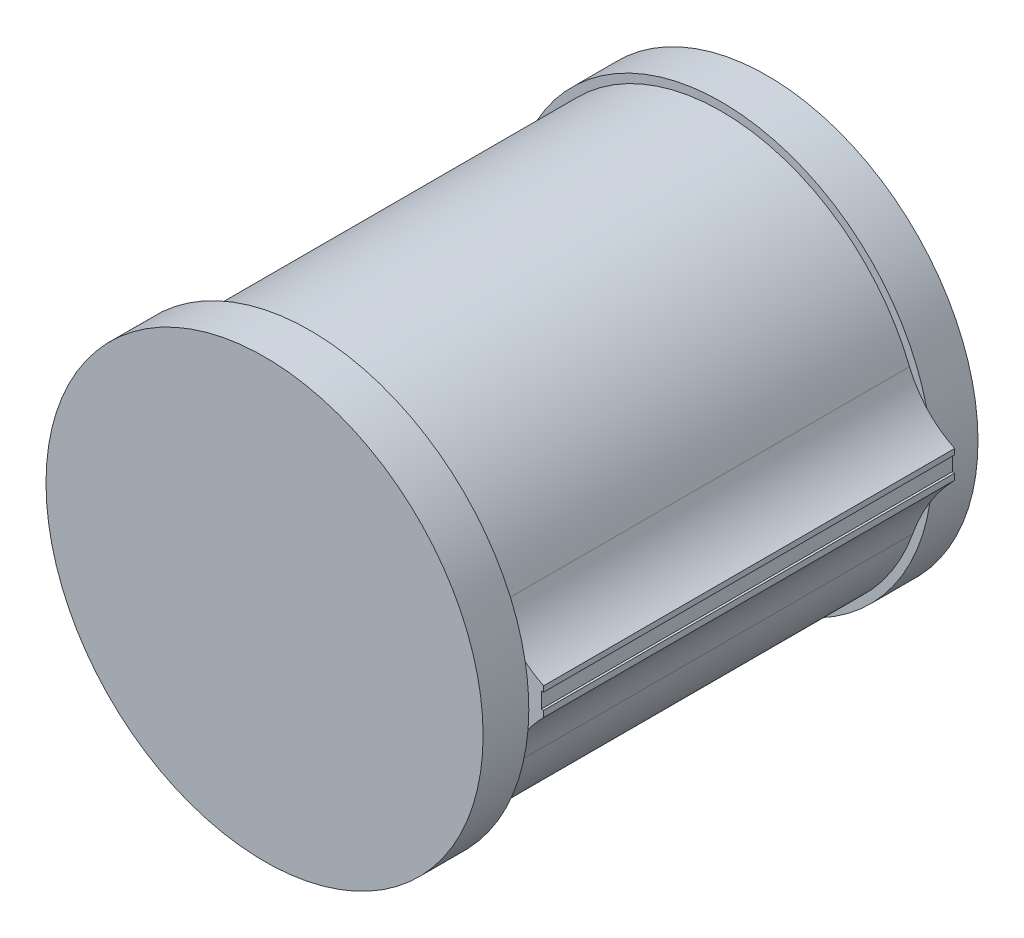
ISO-10303-21;
HEADER;
FILE_DESCRIPTION(('STEP AP214'),'2;1');
FILE_NAME('part.step','',(''),(''),'','','');
FILE_SCHEMA(('AUTOMOTIVE_DESIGN { 1 0 10303 214 1 1 1 1 }'));
ENDSEC;
DATA;
#1=APPLICATION_CONTEXT('core data for automotive mechanical design processes');
#2=APPLICATION_PROTOCOL_DEFINITION('international standard','automotive_design',2000,#1);
#3=PRODUCT_CONTEXT('',#1,'mechanical');
#4=PRODUCT('Part','Part','',(#3));
#5=PRODUCT_RELATED_PRODUCT_CATEGORY('part','',(#4));
#6=PRODUCT_DEFINITION_FORMATION('','',#4);
#7=PRODUCT_DEFINITION_CONTEXT('part definition',#1,'design');
#8=PRODUCT_DEFINITION('design','',#6,#7);
#9=PRODUCT_DEFINITION_SHAPE('','',#8);
#10=(LENGTH_UNIT() NAMED_UNIT(*) SI_UNIT(.MILLI.,.METRE.));
#11=(NAMED_UNIT(*) PLANE_ANGLE_UNIT() SI_UNIT($,.RADIAN.));
#12=(NAMED_UNIT(*) SI_UNIT($,.STERADIAN.) SOLID_ANGLE_UNIT());
#13=UNCERTAINTY_MEASURE_WITH_UNIT(LENGTH_MEASURE(1.E-05),#10,'distance_accuracy_value','');
#14=(GEOMETRIC_REPRESENTATION_CONTEXT(3) GLOBAL_UNCERTAINTY_ASSIGNED_CONTEXT((#13)) GLOBAL_UNIT_ASSIGNED_CONTEXT((#10,
#11,#12)) REPRESENTATION_CONTEXT('',''));
#15=CARTESIAN_POINT('',(0.,0.,0.));
#16=DIRECTION('',(0.,0.,1.));
#17=DIRECTION('',(1.,0.,0.));
#18=AXIS2_PLACEMENT_3D('',#15,#16,#17);
#19=CARTESIAN_POINT('',(-36.7877662650769,-29.4576403006456,40.));
#20=DIRECTION('',(-1.,0.,0.));
#21=DIRECTION('',(0.,0.,1.));
#22=AXIS2_PLACEMENT_3D('',#19,#20,#21);
#23=PLANE('',#22);
#24=DIRECTION('',(0.,1.,0.));
#25=VECTOR('',#24,1.);
#26=CARTESIAN_POINT('',(-36.7877662650769,-29.4576403006456,40.));
#27=LINE('',#26,#25);
#28=CARTESIAN_POINT('',(-36.7877662650769,14.3311362521633,40.));
#29=VERTEX_POINT('',#28);
#30=CARTESIAN_POINT('',(-36.7877662650769,15.5423596993544,40.));
#31=VERTEX_POINT('',#30);
#32=EDGE_CURVE('E146',#29,#31,#27,.T.);
#33=ORIENTED_EDGE('',*,*,#32,.F.);
#34=DIRECTION('',(0.,0.,1.));
#35=VECTOR('',#34,1.);
#36=CARTESIAN_POINT('',(-36.7877662650769,14.3311362521633,40.));
#37=LINE('',#36,#35);
#38=CARTESIAN_POINT('',(-36.7877662650769,14.3311362521633,-50.));
#39=VERTEX_POINT('',#38);
#40=EDGE_CURVE('E127',#39,#29,#37,.T.);
#41=ORIENTED_EDGE('',*,*,#40,.F.);
#42=DIRECTION('',(0.,1.,0.));
#43=VECTOR('',#42,1.);
#44=CARTESIAN_POINT('',(-36.7877662650769,-29.4576403006456,-50.));
#45=LINE('',#44,#43);
#46=CARTESIAN_POINT('',(-36.7877662650769,15.5423596993544,-50.));
#47=VERTEX_POINT('',#46);
#48=EDGE_CURVE('E142',#39,#47,#45,.T.);
#49=ORIENTED_EDGE('',*,*,#48,.T.);
#50=DIRECTION('',(0.,0.,1.));
#51=VECTOR('',#50,1.);
#52=CARTESIAN_POINT('',(-36.7877662650769,15.5423596993544,40.));
#53=LINE('',#52,#51);
#54=EDGE_CURVE('E139',#47,#31,#53,.T.);
#55=ORIENTED_EDGE('',*,*,#54,.T.);
#56=EDGE_LOOP('',(#33,#41,#49,#55));
#57=FACE_BOUND('',#56,.T.);
#58=ADVANCED_FACE('F32',(#57),#23,.F.);
#59=CARTESIAN_POINT('',(-87.8841880463567,9.52001668341595,50.));
#60=DIRECTION('',(0.,0.,-1.));
#61=DIRECTION('',(-1.,0.,0.));
#62=AXIS2_PLACEMENT_3D('',#59,#60,#61);
#63=CYLINDRICAL_SURFACE('',#62,44.4223354879125);
#64=CARTESIAN_POINT('',(-87.8841880463567,9.52001668341595,-50.));
#65=DIRECTION('',(0.,0.,-1.));
#66=DIRECTION('',(-1.,0.,0.));
#67=AXIS2_PLACEMENT_3D('',#64,#65,#66);
#68=CIRCLE('',#67,44.4223354879125);
#69=CARTESIAN_POINT('',(-45.9816918437156,-5.22870197917657,-50.));
#70=VERTEX_POINT('',#69);
#71=CARTESIAN_POINT('',(-46.6721157174866,26.1003961893452,-50.));
#72=VERTEX_POINT('',#71);
#73=EDGE_CURVE('E166',#70,#72,#68,.T.);
#74=ORIENTED_EDGE('',*,*,#73,.F.);
#75=DIRECTION('',(0.,0.,-1.));
#76=VECTOR('',#75,1.);
#77=CARTESIAN_POINT('',(-45.9816918437156,-5.22870197917657,50.));
#78=LINE('',#77,#76);
#79=CARTESIAN_POINT('',(-45.9816918437156,-5.22870197917657,40.));
#80=VERTEX_POINT('',#79);
#81=EDGE_CURVE('E184',#70,#80,#78,.F.);
#82=ORIENTED_EDGE('',*,*,#81,.T.);
#83=CARTESIAN_POINT('',(-87.8841880463567,9.52001668341595,40.));
#84=DIRECTION('',(0.,0.,1.));
#85=DIRECTION('',(1.,0.,0.));
#86=AXIS2_PLACEMENT_3D('',#83,#84,#85);
#87=CIRCLE('',#86,44.4223354879125);
#88=CARTESIAN_POINT('',(-46.6721157174866,26.1003961893452,40.));
#89=VERTEX_POINT('',#88);
#90=EDGE_CURVE('E169',#89,#80,#87,.T.);
#91=ORIENTED_EDGE('',*,*,#90,.F.);
#92=DIRECTION('',(0.,0.,-1.));
#93=VECTOR('',#92,1.);
#94=CARTESIAN_POINT('',(-46.6721157174866,26.1003961893452,50.));
#95=LINE('',#94,#93);
#96=EDGE_CURVE('E172',#89,#72,#95,.T.);
#97=ORIENTED_EDGE('',*,*,#96,.T.);
#98=EDGE_LOOP('',(#74,#82,#91,#97));
#99=FACE_BOUND('',#98,.T.);
#100=ADVANCED_FACE('F229',(#99),#63,.T.);
#101=CARTESIAN_POINT('',(-87.8841880463567,9.52001668341595,-60.));
#102=DIRECTION('',(0.,0.,1.));
#103=DIRECTION('',(1.,0.,0.));
#104=AXIS2_PLACEMENT_3D('',#101,#102,#103);
#105=CYLINDRICAL_SURFACE('',#104,46.1995658048542);
#106=CARTESIAN_POINT('',(-87.8841880463567,9.52001668341595,-60.));
#107=DIRECTION('',(0.,0.,-1.));
#108=DIRECTION('',(-1.,0.,0.));
#109=AXIS2_PLACEMENT_3D('',#106,#107,#108);
#110=CIRCLE('',#109,46.1995658048542);
#111=CARTESIAN_POINT('',(-134.083753851211,9.52001668341595,-60.));
#112=VERTEX_POINT('',#111);
#113=EDGE_CURVE('E163',#112,#112,#110,.T.);
#114=ORIENTED_EDGE('',*,*,#113,.F.);
#115=EDGE_LOOP('',(#114));
#116=FACE_BOUND('',#115,.T.);
#117=CARTESIAN_POINT('',(-87.8841880463567,9.52001668341595,-50.));
#118=DIRECTION('',(0.,0.,-1.));
#119=DIRECTION('',(-1.,0.,0.));
#120=AXIS2_PLACEMENT_3D('',#117,#118,#119);
#121=CIRCLE('',#120,46.1995658048542);
#122=CARTESIAN_POINT('',(-42.9147772678131,20.1101996274288,-50.));
#123=VERTEX_POINT('',#122);
#124=CARTESIAN_POINT('',(-42.1989733391257,2.6453503125105,-50.));
#125=VERTEX_POINT('',#124);
#126=EDGE_CURVE('E46',#123,#125,#121,.T.);
#127=ORIENTED_EDGE('',*,*,#126,.T.);
#128=EDGE_CURVE('E159',#125,#123,#121,.T.);
#129=ORIENTED_EDGE('',*,*,#128,.T.);
#130=EDGE_LOOP('',(#127,#129));
#131=FACE_BOUND('',#130,.T.);
#132=ADVANCED_FACE('F257',(#116,#131),#105,.T.);
#133=CARTESIAN_POINT('',(-87.8841880463567,9.52001668341595,-60.));
#134=DIRECTION('',(0.,0.,-1.));
#135=DIRECTION('',(-1.,0.,0.));
#136=AXIS2_PLACEMENT_3D('',#133,#134,#135);
#137=PLANE('',#136);
#138=CARTESIAN_POINT('',(-87.8841880463567,9.52001668341595,-60.));
#139=DIRECTION('',(0.,0.,-1.));
#140=DIRECTION('',(-1.,0.,0.));
#141=AXIS2_PLACEMENT_3D('',#138,#139,#140);
#142=CIRCLE('',#141,40.5181852656169);
#143=CARTESIAN_POINT('',(-128.402373311974,9.52001668341595,-60.));
#144=VERTEX_POINT('',#143);
#145=EDGE_CURVE('E151',#144,#144,#142,.T.);
#146=ORIENTED_EDGE('',*,*,#145,.F.);
#147=EDGE_LOOP('',(#146));
#148=FACE_BOUND('',#147,.T.);
#149=ORIENTED_EDGE('',*,*,#113,.T.);
#150=EDGE_LOOP('',(#149));
#151=FACE_BOUND('',#150,.T.);
#152=ADVANCED_FACE('F274',(#148,#151),#137,.T.);
#153=CARTESIAN_POINT('',(-87.8841880463567,9.52001668341595,-50.));
#154=DIRECTION('',(0.,0.,-1.));
#155=DIRECTION('',(-1.,0.,0.));
#156=AXIS2_PLACEMENT_3D('',#153,#154,#155);
#157=PLANE('',#156);
#158=ORIENTED_EDGE('',*,*,#128,.F.);
#159=CARTESIAN_POINT('',(-8.25067591003705,-18.5091551571557,-50.));
#160=DIRECTION('',(0.,0.,-1.));
#161=DIRECTION('',(-1.,0.,0.));
#162=AXIS2_PLACEMENT_3D('',#159,#160,#161);
#163=CIRCLE('',#162,40.);
#164=EDGE_CURVE('E189',#125,#70,#163,.F.);
#165=ORIENTED_EDGE('',*,*,#164,.T.);
#166=ORIENTED_EDGE('',*,*,#73,.T.);
#167=CARTESIAN_POINT('',(-28.1174531243486,33.5652803850178,-50.));
#168=DIRECTION('',(0.,0.,-1.));
#169=DIRECTION('',(-1.,0.,0.));
#170=AXIS2_PLACEMENT_3D('',#167,#168,#169);
#171=CIRCLE('',#170,20.);
#172=EDGE_CURVE('E175',#72,#123,#171,.F.);
#173=ORIENTED_EDGE('',*,*,#172,.T.);
#174=EDGE_LOOP('',(#158,#165,#166,#173));
#175=FACE_BOUND('',#174,.T.);
#176=ADVANCED_FACE('F234',(#175),#157,.F.);
#177=CARTESIAN_POINT('',(-87.8841880463567,9.52001668341595,40.));
#178=DIRECTION('',(0.,0.,1.));
#179=DIRECTION('',(1.,0.,0.));
#180=AXIS2_PLACEMENT_3D('',#177,#178,#179);
#181=CYLINDRICAL_SURFACE('',#180,47.848668402323);
#182=CARTESIAN_POINT('',(-87.8841880463567,9.52001668341595,40.));
#183=DIRECTION('',(0.,0.,1.));
#184=DIRECTION('',(1.,0.,0.));
#185=AXIS2_PLACEMENT_3D('',#182,#183,#184);
#186=CIRCLE('',#185,47.848668402323);
#187=CARTESIAN_POINT('',(-40.1997902423232,5.55854297504036,40.));
#188=VERTEX_POINT('',#187);
#189=CARTESIAN_POINT('',(-40.8131645801487,18.1115135098813,40.));
#190=VERTEX_POINT('',#189);
#191=EDGE_CURVE('E54',#188,#190,#186,.T.);
#192=ORIENTED_EDGE('',*,*,#191,.T.);
#193=EDGE_CURVE('E160',#190,#188,#186,.T.);
#194=ORIENTED_EDGE('',*,*,#193,.T.);
#195=EDGE_LOOP('',(#192,#194));
#196=FACE_BOUND('',#195,.T.);
#197=CARTESIAN_POINT('',(-87.8841880463567,9.52001668341595,50.));
#198=DIRECTION('',(0.,0.,1.));
#199=DIRECTION('',(1.,0.,0.));
#200=AXIS2_PLACEMENT_3D('',#197,#198,#199);
#201=CIRCLE('',#200,47.848668402323);
#202=CARTESIAN_POINT('',(-40.0355196440336,9.52001668341595,50.));
#203=VERTEX_POINT('',#202);
#204=EDGE_CURVE('E155',#203,#203,#201,.T.);
#205=ORIENTED_EDGE('',*,*,#204,.F.);
#206=EDGE_LOOP('',(#205));
#207=FACE_BOUND('',#206,.T.);
#208=ADVANCED_FACE('F231',(#196,#207),#181,.T.);
#209=CARTESIAN_POINT('',(-87.8841880463567,9.52001668341595,40.));
#210=DIRECTION('',(0.,0.,1.));
#211=DIRECTION('',(1.,0.,0.));
#212=AXIS2_PLACEMENT_3D('',#209,#210,#211);
#213=PLANE('',#212);
#214=ORIENTED_EDGE('',*,*,#90,.T.);
#215=CARTESIAN_POINT('',(-8.25067591003705,-18.5091551571557,40.));
#216=DIRECTION('',(0.,0.,1.));
#217=DIRECTION('',(1.,0.,0.));
#218=AXIS2_PLACEMENT_3D('',#215,#216,#217);
#219=CIRCLE('',#218,40.);
#220=EDGE_CURVE('E187',#80,#188,#219,.F.);
#221=ORIENTED_EDGE('',*,*,#220,.T.);
#222=ORIENTED_EDGE('',*,*,#193,.F.);
#223=CARTESIAN_POINT('',(-28.1174531243486,33.5652803850178,40.));
#224=DIRECTION('',(0.,0.,1.));
#225=DIRECTION('',(1.,0.,0.));
#226=AXIS2_PLACEMENT_3D('',#223,#224,#225);
#227=CIRCLE('',#226,20.);
#228=EDGE_CURVE('E178',#190,#89,#227,.F.);
#229=ORIENTED_EDGE('',*,*,#228,.T.);
#230=EDGE_LOOP('',(#214,#221,#222,#229));
#231=FACE_BOUND('',#230,.T.);
#232=ADVANCED_FACE('F225',(#231),#213,.F.);
#233=CARTESIAN_POINT('',(-87.8841880463567,9.52001668341595,50.));
#234=DIRECTION('',(0.,0.,1.));
#235=DIRECTION('',(1.,0.,0.));
#236=AXIS2_PLACEMENT_3D('',#233,#234,#235);
#237=PLANE('',#236);
#238=ORIENTED_EDGE('',*,*,#204,.T.);
#239=EDGE_LOOP('',(#238));
#240=FACE_BOUND('',#239,.T.);
#241=ADVANCED_FACE('F238',(#240),#237,.T.);
#242=CARTESIAN_POINT('',(-87.8841880463567,9.52001668341595,45.));
#243=DIRECTION('',(0.,0.,-1.));
#244=DIRECTION('',(-1.,0.,0.));
#245=AXIS2_PLACEMENT_3D('',#242,#243,#244);
#246=CYLINDRICAL_SURFACE('',#245,40.5181852656169);
#247=CARTESIAN_POINT('',(-87.8841880463567,9.52001668341595,45.));
#248=DIRECTION('',(0.,0.,-1.));
#249=DIRECTION('',(-1.,0.,0.));
#250=AXIS2_PLACEMENT_3D('',#247,#248,#249);
#251=CIRCLE('',#250,40.5181852656169);
#252=CARTESIAN_POINT('',(-128.402373311974,9.52001668341595,45.));
#253=VERTEX_POINT('',#252);
#254=EDGE_CURVE('E152',#253,#253,#251,.T.);
#255=ORIENTED_EDGE('',*,*,#254,.F.);
#256=EDGE_LOOP('',(#255));
#257=FACE_BOUND('',#256,.T.);
#258=ORIENTED_EDGE('',*,*,#145,.T.);
#259=EDGE_LOOP('',(#258));
#260=FACE_BOUND('',#259,.T.);
#261=ADVANCED_FACE('F240',(#257,#260),#246,.F.);
#262=CARTESIAN_POINT('',(-87.8841880463567,9.52001668341595,45.));
#263=DIRECTION('',(0.,0.,-1.));
#264=DIRECTION('',(-1.,0.,0.));
#265=AXIS2_PLACEMENT_3D('',#262,#263,#264);
#266=PLANE('',#265);
#267=ORIENTED_EDGE('',*,*,#254,.T.);
#268=EDGE_LOOP('',(#267));
#269=FACE_BOUND('',#268,.T.);
#270=ADVANCED_FACE('F246',(#269),#266,.T.);
#271=CARTESIAN_POINT('',(-45.5,9.52001668341595,-50.));
#272=DIRECTION('',(0.,0.,-1.));
#273=DIRECTION('',(-1.,0.,0.));
#274=AXIS2_PLACEMENT_3D('',#271,#272,#273);
#275=PLANE('',#274);
#276=DIRECTION('',(1.,0.,0.));
#277=VECTOR('',#276,1.);
#278=CARTESIAN_POINT('',(-37.2877662650769,14.3311362521633,-50.));
#279=LINE('',#278,#277);
#280=CARTESIAN_POINT('',(-37.2877662650769,14.3311362521633,-50.));
#281=VERTEX_POINT('',#280);
#282=EDGE_CURVE('E134',#281,#39,#279,.T.);
#283=ORIENTED_EDGE('',*,*,#282,.F.);
#284=DIRECTION('',(0.,1.,0.));
#285=VECTOR('',#284,1.);
#286=CARTESIAN_POINT('',(-37.2877662650769,10.8840151509298,-50.));
#287=LINE('',#286,#285);
#288=CARTESIAN_POINT('',(-37.2877662650769,10.8840151509298,-50.));
#289=VERTEX_POINT('',#288);
#290=EDGE_CURVE('E118',#289,#281,#287,.T.);
#291=ORIENTED_EDGE('',*,*,#290,.F.);
#292=DIRECTION('',(1.,0.,0.));
#293=VECTOR('',#292,1.);
#294=CARTESIAN_POINT('',(-37.2877662650769,10.8840151509298,-50.));
#295=LINE('',#294,#293);
#296=CARTESIAN_POINT('',(-36.7877662650769,10.8840151509298,-50.));
#297=VERTEX_POINT('',#296);
#298=EDGE_CURVE('E115',#289,#297,#295,.T.);
#299=ORIENTED_EDGE('',*,*,#298,.T.);
#300=CARTESIAN_POINT('',(-36.7877662650769,9.52001668341595,-50.));
#301=VERTEX_POINT('',#300);
#302=EDGE_CURVE('E147',#301,#297,#45,.T.);
#303=ORIENTED_EDGE('',*,*,#302,.F.);
#304=CARTESIAN_POINT('',(-8.25067591003705,-18.5091551571557,-50.));
#305=DIRECTION('',(0.,0.,-1.));
#306=DIRECTION('',(-1.,0.,0.));
#307=AXIS2_PLACEMENT_3D('',#304,#305,#306);
#308=CIRCLE('',#307,40.);
#309=EDGE_CURVE('E11',#301,#125,#308,.F.);
#310=ORIENTED_EDGE('',*,*,#309,.T.);
#311=ORIENTED_EDGE('',*,*,#126,.F.);
#312=CARTESIAN_POINT('',(-28.1174531243486,33.5652803850178,-50.));
#313=DIRECTION('',(0.,0.,-1.));
#314=DIRECTION('',(-1.,0.,0.));
#315=AXIS2_PLACEMENT_3D('',#312,#313,#314);
#316=CIRCLE('',#315,20.);
#317=EDGE_CURVE('E180',#123,#47,#316,.F.);
#318=ORIENTED_EDGE('',*,*,#317,.T.);
#319=ORIENTED_EDGE('',*,*,#48,.F.);
#320=EDGE_LOOP('',(#283,#291,#299,#303,#310,#311,#318,#319));
#321=FACE_BOUND('',#320,.T.);
#322=ADVANCED_FACE('F202',(#321),#275,.T.);
#323=CARTESIAN_POINT('',(-45.5,15.5423596993544,40.));
#324=DIRECTION('',(0.,0.,1.));
#325=DIRECTION('',(0.,-1.,0.));
#326=AXIS2_PLACEMENT_3D('',#323,#324,#325);
#327=PLANE('',#326);
#328=DIRECTION('',(1.,0.,0.));
#329=VECTOR('',#328,1.);
#330=CARTESIAN_POINT('',(-37.2877662650769,14.3311362521633,40.));
#331=LINE('',#330,#329);
#332=CARTESIAN_POINT('',(-37.2877662650769,14.3311362521633,40.));
#333=VERTEX_POINT('',#332);
#334=EDGE_CURVE('E143',#333,#29,#331,.T.);
#335=ORIENTED_EDGE('',*,*,#334,.T.);
#336=ORIENTED_EDGE('',*,*,#32,.T.);
#337=CARTESIAN_POINT('',(-28.1174531243486,33.5652803850178,40.));
#338=DIRECTION('',(0.,0.,1.));
#339=DIRECTION('',(0.,-1.,0.));
#340=AXIS2_PLACEMENT_3D('',#337,#338,#339);
#341=CIRCLE('',#340,20.);
#342=EDGE_CURVE('E182',#31,#190,#341,.F.);
#343=ORIENTED_EDGE('',*,*,#342,.T.);
#344=ORIENTED_EDGE('',*,*,#191,.F.);
#345=CARTESIAN_POINT('',(-8.25067591003705,-18.5091551571557,40.));
#346=DIRECTION('',(0.,0.,1.));
#347=DIRECTION('',(0.,-1.,0.));
#348=AXIS2_PLACEMENT_3D('',#345,#346,#347);
#349=CIRCLE('',#348,40.);
#350=CARTESIAN_POINT('',(-36.7877662650769,9.52001668341594,40.));
#351=VERTEX_POINT('',#350);
#352=EDGE_CURVE('E40',#188,#351,#349,.F.);
#353=ORIENTED_EDGE('',*,*,#352,.T.);
#354=CARTESIAN_POINT('',(-36.7877662650769,10.8840151509298,40.));
#355=VERTEX_POINT('',#354);
#356=EDGE_CURVE('E132',#351,#355,#27,.T.);
#357=ORIENTED_EDGE('',*,*,#356,.T.);
#358=DIRECTION('',(1.,0.,0.));
#359=VECTOR('',#358,1.);
#360=CARTESIAN_POINT('',(-37.2877662650769,10.8840151509298,40.));
#361=LINE('',#360,#359);
#362=CARTESIAN_POINT('',(-37.2877662650769,10.8840151509298,40.));
#363=VERTEX_POINT('',#362);
#364=EDGE_CURVE('E112',#363,#355,#361,.T.);
#365=ORIENTED_EDGE('',*,*,#364,.F.);
#366=DIRECTION('',(0.,-1.,0.));
#367=VECTOR('',#366,1.);
#368=CARTESIAN_POINT('',(-37.2877662650769,10.8840151509298,40.));
#369=LINE('',#368,#367);
#370=EDGE_CURVE('E119',#333,#363,#369,.T.);
#371=ORIENTED_EDGE('',*,*,#370,.F.);
#372=EDGE_LOOP('',(#335,#336,#343,#344,#353,#357,#365,#371));
#373=FACE_BOUND('',#372,.T.);
#374=ADVANCED_FACE('F130',(#373),#327,.T.);
#375=ORIENTED_EDGE('',*,*,#302,.T.);
#376=DIRECTION('',(0.,0.,-1.));
#377=VECTOR('',#376,1.);
#378=CARTESIAN_POINT('',(-36.7877662650769,10.8840151509298,40.));
#379=LINE('',#378,#377);
#380=EDGE_CURVE('E196',#355,#297,#379,.T.);
#381=ORIENTED_EDGE('',*,*,#380,.F.);
#382=ORIENTED_EDGE('',*,*,#356,.F.);
#383=DIRECTION('',(0.,0.,-1.));
#384=VECTOR('',#383,1.);
#385=CARTESIAN_POINT('',(-36.7877662650769,9.52001668341594,40.));
#386=LINE('',#385,#384);
#387=EDGE_CURVE('E145',#351,#301,#386,.T.);
#388=ORIENTED_EDGE('',*,*,#387,.T.);
#389=EDGE_LOOP('',(#375,#381,#382,#388));
#390=FACE_BOUND('',#389,.T.);
#391=ADVANCED_FACE('F194',(#390),#23,.F.);
#392=CARTESIAN_POINT('',(-37.2877662650769,14.3311362521633,40.));
#393=DIRECTION('',(0.,1.,0.));
#394=DIRECTION('',(0.,0.,1.));
#395=AXIS2_PLACEMENT_3D('',#392,#393,#394);
#396=PLANE('',#395);
#397=ORIENTED_EDGE('',*,*,#40,.T.);
#398=ORIENTED_EDGE('',*,*,#334,.F.);
#399=DIRECTION('',(0.,0.,1.));
#400=VECTOR('',#399,1.);
#401=CARTESIAN_POINT('',(-37.2877662650769,14.3311362521633,40.));
#402=LINE('',#401,#400);
#403=EDGE_CURVE('E125',#281,#333,#402,.T.);
#404=ORIENTED_EDGE('',*,*,#403,.F.);
#405=ORIENTED_EDGE('',*,*,#282,.T.);
#406=EDGE_LOOP('',(#397,#398,#404,#405));
#407=FACE_BOUND('',#406,.T.);
#408=ADVANCED_FACE('F210',(#407),#396,.F.);
#409=CARTESIAN_POINT('',(-37.2877662650769,10.8840151509298,40.));
#410=DIRECTION('',(0.,-1.,0.));
#411=DIRECTION('',(0.,0.,-1.));
#412=AXIS2_PLACEMENT_3D('',#409,#410,#411);
#413=PLANE('',#412);
#414=ORIENTED_EDGE('',*,*,#380,.T.);
#415=ORIENTED_EDGE('',*,*,#298,.F.);
#416=DIRECTION('',(0.,0.,-1.));
#417=VECTOR('',#416,1.);
#418=CARTESIAN_POINT('',(-37.2877662650769,10.8840151509298,40.));
#419=LINE('',#418,#417);
#420=EDGE_CURVE('E108',#363,#289,#419,.T.);
#421=ORIENTED_EDGE('',*,*,#420,.F.);
#422=ORIENTED_EDGE('',*,*,#364,.T.);
#423=EDGE_LOOP('',(#414,#415,#421,#422));
#424=FACE_BOUND('',#423,.T.);
#425=ADVANCED_FACE('F110',(#424),#413,.F.);
#426=CARTESIAN_POINT('',(-37.2877662650769,0.,0.));
#427=DIRECTION('',(-1.,0.,0.));
#428=DIRECTION('',(0.,0.,1.));
#429=AXIS2_PLACEMENT_3D('',#426,#427,#428);
#430=PLANE('',#429);
#431=ORIENTED_EDGE('',*,*,#370,.T.);
#432=ORIENTED_EDGE('',*,*,#420,.T.);
#433=ORIENTED_EDGE('',*,*,#290,.T.);
#434=ORIENTED_EDGE('',*,*,#403,.T.);
#435=EDGE_LOOP('',(#431,#432,#433,#434));
#436=FACE_BOUND('',#435,.T.);
#437=ADVANCED_FACE('F123',(#436),#430,.F.);
#438=CARTESIAN_POINT('',(-28.1174531243486,33.5652803850178,-50.));
#439=DIRECTION('',(0.,0.,1.));
#440=DIRECTION('',(1.,0.,0.));
#441=AXIS2_PLACEMENT_3D('',#438,#439,#440);
#442=CYLINDRICAL_SURFACE('',#441,20.);
#443=ORIENTED_EDGE('',*,*,#342,.F.);
#444=ORIENTED_EDGE('',*,*,#54,.F.);
#445=ORIENTED_EDGE('',*,*,#317,.F.);
#446=ORIENTED_EDGE('',*,*,#172,.F.);
#447=ORIENTED_EDGE('',*,*,#96,.F.);
#448=ORIENTED_EDGE('',*,*,#228,.F.);
#449=EDGE_LOOP('',(#443,#444,#445,#446,#447,#448));
#450=FACE_BOUND('',#449,.T.);
#451=ADVANCED_FACE('F219',(#450),#442,.F.);
#452=CARTESIAN_POINT('',(-8.25067591003705,-18.5091551571557,40.));
#453=DIRECTION('',(0.,0.,-1.));
#454=DIRECTION('',(-1.,0.,0.));
#455=AXIS2_PLACEMENT_3D('',#452,#453,#454);
#456=CYLINDRICAL_SURFACE('',#455,40.);
#457=ORIENTED_EDGE('',*,*,#309,.F.);
#458=ORIENTED_EDGE('',*,*,#387,.F.);
#459=ORIENTED_EDGE('',*,*,#352,.F.);
#460=ORIENTED_EDGE('',*,*,#220,.F.);
#461=ORIENTED_EDGE('',*,*,#81,.F.);
#462=ORIENTED_EDGE('',*,*,#164,.F.);
#463=EDGE_LOOP('',(#457,#458,#459,#460,#461,#462));
#464=FACE_BOUND('',#463,.T.);
#465=ADVANCED_FACE('F34',(#464),#456,.F.);
#466=CLOSED_SHELL('',(#58,#100,#132,#152,#176,#208,#232,#241,#261,#270,#322,#374,#391,#408,#425,
#437,#451,#465));
#467=MANIFOLD_SOLID_BREP('B2',#466);
#468=ADVANCED_BREP_SHAPE_REPRESENTATION('',(#18,#467),#14);
#469=SHAPE_DEFINITION_REPRESENTATION(#9,#468);
ENDSEC;
END-ISO-10303-21;
